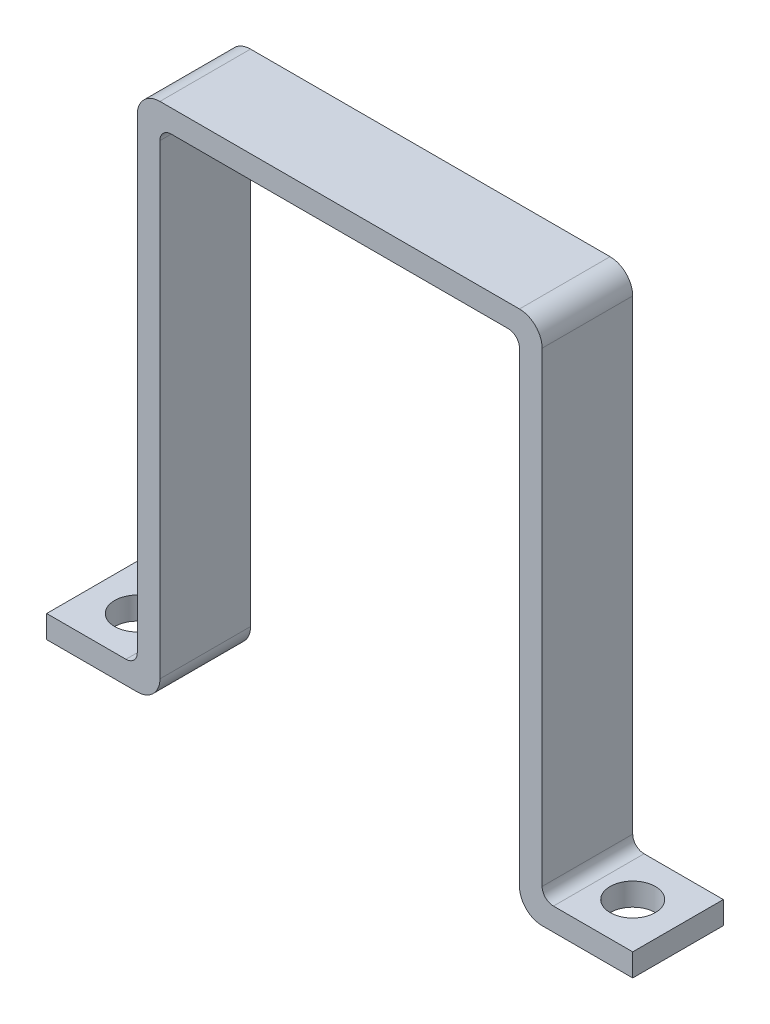
ISO-10303-21;
HEADER;
FILE_DESCRIPTION(('STEP AP214'),'2;1');
FILE_NAME('part.step','',(''),(''),'','','');
FILE_SCHEMA(('AUTOMOTIVE_DESIGN { 1 0 10303 214 1 1 1 1 }'));
ENDSEC;
DATA;
#1=APPLICATION_CONTEXT('core data for automotive mechanical design processes');
#2=APPLICATION_PROTOCOL_DEFINITION('international standard','automotive_design',2000,#1);
#3=PRODUCT_CONTEXT('',#1,'mechanical');
#4=PRODUCT('Part','Part','',(#3));
#5=PRODUCT_RELATED_PRODUCT_CATEGORY('part','',(#4));
#6=PRODUCT_DEFINITION_FORMATION('','',#4);
#7=PRODUCT_DEFINITION_CONTEXT('part definition',#1,'design');
#8=PRODUCT_DEFINITION('design','',#6,#7);
#9=PRODUCT_DEFINITION_SHAPE('','',#8);
#10=(LENGTH_UNIT() NAMED_UNIT(*) SI_UNIT(.MILLI.,.METRE.));
#11=(NAMED_UNIT(*) PLANE_ANGLE_UNIT() SI_UNIT($,.RADIAN.));
#12=(NAMED_UNIT(*) SI_UNIT($,.STERADIAN.) SOLID_ANGLE_UNIT());
#13=UNCERTAINTY_MEASURE_WITH_UNIT(LENGTH_MEASURE(1.E-05),#10,'distance_accuracy_value','');
#14=(GEOMETRIC_REPRESENTATION_CONTEXT(3) GLOBAL_UNCERTAINTY_ASSIGNED_CONTEXT((#13)) GLOBAL_UNIT_ASSIGNED_CONTEXT((#10,
#11,#12)) REPRESENTATION_CONTEXT('',''));
#15=CARTESIAN_POINT('',(0.,0.,0.));
#16=DIRECTION('',(0.,0.,1.));
#17=DIRECTION('',(1.,0.,0.));
#18=AXIS2_PLACEMENT_3D('',#15,#16,#17);
#19=CARTESIAN_POINT('',(0.,70.104,0.));
#20=DIRECTION('',(0.,1.,0.));
#21=DIRECTION('',(0.,0.,1.));
#22=AXIS2_PLACEMENT_3D('',#19,#20,#21);
#23=PLANE('',#22);
#24=DIRECTION('',(1.,0.,0.));
#25=VECTOR('',#24,1.);
#26=CARTESIAN_POINT('',(0.,70.104,6.35000000000001));
#27=LINE('',#26,#25);
#28=CARTESIAN_POINT('',(-58.3375,70.104,6.35000000000001));
#29=VERTEX_POINT('',#28);
#30=CARTESIAN_POINT('',(-11.1125,70.104,6.35000000000001));
#31=VERTEX_POINT('',#30);
#32=EDGE_CURVE('E234',#29,#31,#27,.T.);
#33=ORIENTED_EDGE('',*,*,#32,.F.);
#34=DIRECTION('',(0.,0.,1.));
#35=VECTOR('',#34,1.);
#36=CARTESIAN_POINT('',(-58.3375,70.104,0.));
#37=LINE('',#36,#35);
#38=CARTESIAN_POINT('',(-58.3375,70.104,-6.34999999999999));
#39=VERTEX_POINT('',#38);
#40=EDGE_CURVE('E381',#29,#39,#37,.F.);
#41=ORIENTED_EDGE('',*,*,#40,.T.);
#42=DIRECTION('',(-1.,0.,0.));
#43=VECTOR('',#42,1.);
#44=CARTESIAN_POINT('',(0.,70.104,-6.34999999999999));
#45=LINE('',#44,#43);
#46=CARTESIAN_POINT('',(-11.1125,70.104,-6.34999999999999));
#47=VERTEX_POINT('',#46);
#48=EDGE_CURVE('E237',#47,#39,#45,.T.);
#49=ORIENTED_EDGE('',*,*,#48,.F.);
#50=DIRECTION('',(0.,0.,-1.));
#51=VECTOR('',#50,1.);
#52=CARTESIAN_POINT('',(-11.1125,70.104,6.35000000000001));
#53=LINE('',#52,#51);
#54=EDGE_CURVE('E378',#47,#31,#53,.F.);
#55=ORIENTED_EDGE('',*,*,#54,.T.);
#56=EDGE_LOOP('',(#33,#41,#49,#55));
#57=FACE_BOUND('',#56,.T.);
#58=ADVANCED_FACE('F41',(#57),#23,.F.);
#59=CARTESIAN_POINT('',(-59.925,3.175,0.));
#60=DIRECTION('',(1.,0.,0.));
#61=DIRECTION('',(0.,0.,-1.));
#62=AXIS2_PLACEMENT_3D('',#59,#60,#61);
#63=PLANE('',#62);
#64=DIRECTION('',(0.,-1.,0.));
#65=VECTOR('',#64,1.);
#66=CARTESIAN_POINT('',(-59.925,3.175,-6.34999999999999));
#67=LINE('',#66,#65);
#68=CARTESIAN_POINT('',(-59.925,68.5165,-6.34999999999999));
#69=VERTEX_POINT('',#68);
#70=CARTESIAN_POINT('',(-59.925,3.175,-6.34999999999999));
#71=VERTEX_POINT('',#70);
#72=EDGE_CURVE('E300',#69,#71,#67,.T.);
#73=ORIENTED_EDGE('',*,*,#72,.F.);
#74=DIRECTION('',(0.,0.,1.));
#75=VECTOR('',#74,1.);
#76=CARTESIAN_POINT('',(-59.925,68.5165,0.));
#77=LINE('',#76,#75);
#78=CARTESIAN_POINT('',(-59.925,68.5165,6.35000000000001));
#79=VERTEX_POINT('',#78);
#80=EDGE_CURVE('E374',#69,#79,#77,.T.);
#81=ORIENTED_EDGE('',*,*,#80,.T.);
#82=DIRECTION('',(0.,-1.,0.));
#83=VECTOR('',#82,1.);
#84=CARTESIAN_POINT('',(-59.925,3.175,6.35000000000001));
#85=LINE('',#84,#83);
#86=CARTESIAN_POINT('',(-59.925,3.175,6.35000000000001));
#87=VERTEX_POINT('',#86);
#88=EDGE_CURVE('E303',#79,#87,#85,.T.);
#89=ORIENTED_EDGE('',*,*,#88,.T.);
#90=DIRECTION('',(0.,0.,1.));
#91=VECTOR('',#90,1.);
#92=CARTESIAN_POINT('',(-59.925,3.175,-6.34999999999999));
#93=LINE('',#92,#91);
#94=EDGE_CURVE('E323',#87,#71,#93,.F.);
#95=ORIENTED_EDGE('',*,*,#94,.T.);
#96=EDGE_LOOP('',(#73,#81,#89,#95));
#97=FACE_BOUND('',#96,.T.);
#98=ADVANCED_FACE('F478',(#97),#63,.T.);
#99=CARTESIAN_POINT('',(0.,3.175,6.35000000000001));
#100=DIRECTION('',(0.,0.,-1.));
#101=DIRECTION('',(-1.,0.,0.));
#102=AXIS2_PLACEMENT_3D('',#99,#100,#101);
#103=PLANE('',#102);
#104=DIRECTION('',(1.,0.,0.));
#105=VECTOR('',#104,1.);
#106=CARTESIAN_POINT('',(0.,0.,6.35000000000001));
#107=LINE('',#106,#105);
#108=CARTESIAN_POINT('',(-75.8,0.,6.35000000000001));
#109=VERTEX_POINT('',#108);
#110=CARTESIAN_POINT('',(-63.1,0.,6.35000000000001));
#111=VERTEX_POINT('',#110);
#112=EDGE_CURVE('E285',#109,#111,#107,.T.);
#113=ORIENTED_EDGE('',*,*,#112,.T.);
#114=CARTESIAN_POINT('',(-63.1,3.175,6.35000000000001));
#115=DIRECTION('',(0.,0.,-1.));
#116=DIRECTION('',(-1.,0.,0.));
#117=AXIS2_PLACEMENT_3D('',#114,#115,#116);
#118=CIRCLE('',#117,3.175);
#119=EDGE_CURVE('E319',#111,#87,#118,.F.);
#120=ORIENTED_EDGE('',*,*,#119,.T.);
#121=ORIENTED_EDGE('',*,*,#88,.F.);
#122=CARTESIAN_POINT('',(-58.3375,68.5165,6.35000000000001));
#123=DIRECTION('',(0.,0.,-1.));
#124=DIRECTION('',(-1.,0.,0.));
#125=AXIS2_PLACEMENT_3D('',#122,#123,#124);
#126=CIRCLE('',#125,1.5875);
#127=EDGE_CURVE('E399',#79,#29,#126,.T.);
#128=ORIENTED_EDGE('',*,*,#127,.T.);
#129=ORIENTED_EDGE('',*,*,#32,.T.);
#130=CARTESIAN_POINT('',(-11.1125,68.5165,6.35000000000001));
#131=DIRECTION('',(0.,0.,-1.));
#132=DIRECTION('',(-1.,0.,0.));
#133=AXIS2_PLACEMENT_3D('',#130,#131,#132);
#134=CIRCLE('',#133,1.5875);
#135=CARTESIAN_POINT('',(-9.525,68.5165,6.35));
#136=VERTEX_POINT('',#135);
#137=EDGE_CURVE('E11',#31,#136,#134,.T.);
#138=ORIENTED_EDGE('',*,*,#137,.T.);
#139=DIRECTION('',(0.,-1.,0.));
#140=VECTOR('',#139,1.);
#141=CARTESIAN_POINT('',(-9.525,3.175,6.35));
#142=LINE('',#141,#140);
#143=CARTESIAN_POINT('',(-9.525,3.175,6.35));
#144=VERTEX_POINT('',#143);
#145=EDGE_CURVE('E189',#136,#144,#142,.T.);
#146=ORIENTED_EDGE('',*,*,#145,.T.);
#147=CARTESIAN_POINT('',(-6.35,3.175,6.35000000000001));
#148=DIRECTION('',(0.,0.,-1.));
#149=DIRECTION('',(-1.,0.,0.));
#150=AXIS2_PLACEMENT_3D('',#147,#148,#149);
#151=CIRCLE('',#150,3.175);
#152=CARTESIAN_POINT('',(-6.35,0.,6.35));
#153=VERTEX_POINT('',#152);
#154=EDGE_CURVE('E316',#144,#153,#151,.F.);
#155=ORIENTED_EDGE('',*,*,#154,.T.);
#156=DIRECTION('',(-1.,0.,0.));
#157=VECTOR('',#156,1.);
#158=CARTESIAN_POINT('',(0.,0.,6.35));
#159=LINE('',#158,#157);
#160=CARTESIAN_POINT('',(6.35,0.,6.35));
#161=VERTEX_POINT('',#160);
#162=EDGE_CURVE('E184',#161,#153,#159,.T.);
#163=ORIENTED_EDGE('',*,*,#162,.F.);
#164=DIRECTION('',(0.,-1.,0.));
#165=VECTOR('',#164,1.);
#166=CARTESIAN_POINT('',(6.35,3.175,6.35));
#167=LINE('',#166,#165);
#168=CARTESIAN_POINT('',(6.35,3.175,6.35));
#169=VERTEX_POINT('',#168);
#170=EDGE_CURVE('E177',#169,#161,#167,.T.);
#171=ORIENTED_EDGE('',*,*,#170,.F.);
#172=DIRECTION('',(-1.,0.,0.));
#173=VECTOR('',#172,1.);
#174=CARTESIAN_POINT('',(0.,3.175,6.35));
#175=LINE('',#174,#173);
#176=CARTESIAN_POINT('',(-4.7625,3.175,6.35));
#177=VERTEX_POINT('',#176);
#178=EDGE_CURVE('E182',#169,#177,#175,.T.);
#179=ORIENTED_EDGE('',*,*,#178,.T.);
#180=CARTESIAN_POINT('',(-4.7625,4.7625,6.35000000000001));
#181=DIRECTION('',(0.,0.,-1.));
#182=DIRECTION('',(-1.,0.,0.));
#183=AXIS2_PLACEMENT_3D('',#180,#181,#182);
#184=CIRCLE('',#183,1.5875);
#185=CARTESIAN_POINT('',(-6.35,4.7625,6.35));
#186=VERTEX_POINT('',#185);
#187=EDGE_CURVE('E393',#177,#186,#184,.T.);
#188=ORIENTED_EDGE('',*,*,#187,.T.);
#189=DIRECTION('',(0.,1.,0.));
#190=VECTOR('',#189,1.);
#191=CARTESIAN_POINT('',(-6.35,70.104,6.35));
#192=LINE('',#191,#190);
#193=CARTESIAN_POINT('',(-6.35,70.104,6.35));
#194=VERTEX_POINT('',#193);
#195=EDGE_CURVE('E241',#186,#194,#192,.T.);
#196=ORIENTED_EDGE('',*,*,#195,.T.);
#197=CARTESIAN_POINT('',(-9.525,70.104,6.35000000000001));
#198=DIRECTION('',(0.,0.,-1.));
#199=DIRECTION('',(-1.,0.,0.));
#200=AXIS2_PLACEMENT_3D('',#197,#198,#199);
#201=CIRCLE('',#200,3.175);
#202=CARTESIAN_POINT('',(-9.525,73.279,6.35000000000001));
#203=VERTEX_POINT('',#202);
#204=EDGE_CURVE('E310',#194,#203,#201,.F.);
#205=ORIENTED_EDGE('',*,*,#204,.T.);
#206=DIRECTION('',(1.,0.,0.));
#207=VECTOR('',#206,1.);
#208=CARTESIAN_POINT('',(0.,73.279,6.35000000000001));
#209=LINE('',#208,#207);
#210=CARTESIAN_POINT('',(-59.925,73.279,6.35000000000001));
#211=VERTEX_POINT('',#210);
#212=EDGE_CURVE('E251',#211,#203,#209,.T.);
#213=ORIENTED_EDGE('',*,*,#212,.F.);
#214=CARTESIAN_POINT('',(-59.925,70.104,6.35000000000001));
#215=DIRECTION('',(0.,0.,-1.));
#216=DIRECTION('',(-1.,0.,0.));
#217=AXIS2_PLACEMENT_3D('',#214,#215,#216);
#218=CIRCLE('',#217,3.175);
#219=CARTESIAN_POINT('',(-63.1,70.104,6.35000000000001));
#220=VERTEX_POINT('',#219);
#221=EDGE_CURVE('E313',#211,#220,#218,.F.);
#222=ORIENTED_EDGE('',*,*,#221,.T.);
#223=DIRECTION('',(0.,-1.,0.));
#224=VECTOR('',#223,1.);
#225=CARTESIAN_POINT('',(-63.1,73.279,6.35000000000001));
#226=LINE('',#225,#224);
#227=CARTESIAN_POINT('',(-63.1,4.7625,6.35000000000001));
#228=VERTEX_POINT('',#227);
#229=EDGE_CURVE('E255',#220,#228,#226,.T.);
#230=ORIENTED_EDGE('',*,*,#229,.T.);
#231=CARTESIAN_POINT('',(-64.6875,4.7625,6.35000000000001));
#232=DIRECTION('',(0.,0.,-1.));
#233=DIRECTION('',(-1.,0.,0.));
#234=AXIS2_PLACEMENT_3D('',#231,#232,#233);
#235=CIRCLE('',#234,1.5875);
#236=CARTESIAN_POINT('',(-64.6875,3.175,6.35000000000001));
#237=VERTEX_POINT('',#236);
#238=EDGE_CURVE('E387',#228,#237,#235,.T.);
#239=ORIENTED_EDGE('',*,*,#238,.T.);
#240=DIRECTION('',(1.,0.,0.));
#241=VECTOR('',#240,1.);
#242=CARTESIAN_POINT('',(0.,3.175,6.35000000000001));
#243=LINE('',#242,#241);
#244=CARTESIAN_POINT('',(-75.8,3.175,6.35000000000001));
#245=VERTEX_POINT('',#244);
#246=EDGE_CURVE('E268',#245,#237,#243,.T.);
#247=ORIENTED_EDGE('',*,*,#246,.F.);
#248=DIRECTION('',(0.,-1.,0.));
#249=VECTOR('',#248,1.);
#250=CARTESIAN_POINT('',(-75.8,3.175,6.35000000000001));
#251=LINE('',#250,#249);
#252=EDGE_CURVE('E281',#245,#109,#251,.T.);
#253=ORIENTED_EDGE('',*,*,#252,.T.);
#254=EDGE_LOOP('',(#113,#120,#121,#128,#129,#138,#146,#155,#163,#171,#179,#188,#196,#205,#213,
#222,#230,#239,#247,#253));
#255=FACE_BOUND('',#254,.T.);
#256=ADVANCED_FACE('F180',(#255),#103,.F.);
#257=CARTESIAN_POINT('',(0.,3.175,-6.34999999999999));
#258=DIRECTION('',(0.,0.,-1.));
#259=DIRECTION('',(-1.,0.,0.));
#260=AXIS2_PLACEMENT_3D('',#257,#258,#259);
#261=PLANE('',#260);
#262=ORIENTED_EDGE('',*,*,#48,.T.);
#263=CARTESIAN_POINT('',(-58.3375,68.5165,-6.34999999999999));
#264=DIRECTION('',(0.,0.,-1.));
#265=DIRECTION('',(-1.,0.,0.));
#266=AXIS2_PLACEMENT_3D('',#263,#264,#265);
#267=CIRCLE('',#266,1.5875);
#268=EDGE_CURVE('E402',#39,#69,#267,.F.);
#269=ORIENTED_EDGE('',*,*,#268,.T.);
#270=ORIENTED_EDGE('',*,*,#72,.T.);
#271=CARTESIAN_POINT('',(-63.1,3.175,-6.34999999999999));
#272=DIRECTION('',(0.,0.,-1.));
#273=DIRECTION('',(-1.,0.,0.));
#274=AXIS2_PLACEMENT_3D('',#271,#272,#273);
#275=CIRCLE('',#274,3.175);
#276=CARTESIAN_POINT('',(-63.1,0.,-6.34999999999999));
#277=VERTEX_POINT('',#276);
#278=EDGE_CURVE('E338',#71,#277,#275,.T.);
#279=ORIENTED_EDGE('',*,*,#278,.T.);
#280=DIRECTION('',(1.,0.,0.));
#281=VECTOR('',#280,1.);
#282=CARTESIAN_POINT('',(0.,0.,-6.34999999999999));
#283=LINE('',#282,#281);
#284=CARTESIAN_POINT('',(-75.8,0.,-6.34999999999999));
#285=VERTEX_POINT('',#284);
#286=EDGE_CURVE('E288',#285,#277,#283,.T.);
#287=ORIENTED_EDGE('',*,*,#286,.F.);
#288=DIRECTION('',(0.,-1.,0.));
#289=VECTOR('',#288,1.);
#290=CARTESIAN_POINT('',(-75.8,3.175,-6.34999999999999));
#291=LINE('',#290,#289);
#292=CARTESIAN_POINT('',(-75.8,3.175,-6.34999999999999));
#293=VERTEX_POINT('',#292);
#294=EDGE_CURVE('E297',#293,#285,#291,.T.);
#295=ORIENTED_EDGE('',*,*,#294,.F.);
#296=DIRECTION('',(1.,0.,0.));
#297=VECTOR('',#296,1.);
#298=CARTESIAN_POINT('',(0.,3.175,-6.34999999999999));
#299=LINE('',#298,#297);
#300=CARTESIAN_POINT('',(-64.6875,3.175,-6.34999999999999));
#301=VERTEX_POINT('',#300);
#302=EDGE_CURVE('E273',#293,#301,#299,.T.);
#303=ORIENTED_EDGE('',*,*,#302,.T.);
#304=CARTESIAN_POINT('',(-64.6875,4.7625,-6.34999999999999));
#305=DIRECTION('',(0.,0.,-1.));
#306=DIRECTION('',(-1.,0.,0.));
#307=AXIS2_PLACEMENT_3D('',#304,#305,#306);
#308=CIRCLE('',#307,1.5875);
#309=CARTESIAN_POINT('',(-63.1,4.7625,-6.34999999999999));
#310=VERTEX_POINT('',#309);
#311=EDGE_CURVE('E390',#301,#310,#308,.F.);
#312=ORIENTED_EDGE('',*,*,#311,.T.);
#313=DIRECTION('',(0.,-1.,0.));
#314=VECTOR('',#313,1.);
#315=CARTESIAN_POINT('',(-63.1,73.279,-6.34999999999999));
#316=LINE('',#315,#314);
#317=CARTESIAN_POINT('',(-63.1,70.104,-6.34999999999999));
#318=VERTEX_POINT('',#317);
#319=EDGE_CURVE('E259',#318,#310,#316,.T.);
#320=ORIENTED_EDGE('',*,*,#319,.F.);
#321=CARTESIAN_POINT('',(-59.925,70.104,-6.34999999999999));
#322=DIRECTION('',(0.,0.,-1.));
#323=DIRECTION('',(-1.,0.,0.));
#324=AXIS2_PLACEMENT_3D('',#321,#322,#323);
#325=CIRCLE('',#324,3.175);
#326=CARTESIAN_POINT('',(-59.925,73.279,-6.34999999999999));
#327=VERTEX_POINT('',#326);
#328=EDGE_CURVE('E331',#318,#327,#325,.T.);
#329=ORIENTED_EDGE('',*,*,#328,.T.);
#330=DIRECTION('',(-1.,0.,0.));
#331=VECTOR('',#330,1.);
#332=CARTESIAN_POINT('',(0.,73.279,-6.34999999999999));
#333=LINE('',#332,#331);
#334=CARTESIAN_POINT('',(-9.525,73.279,-6.34999999999999));
#335=VERTEX_POINT('',#334);
#336=EDGE_CURVE('E245',#335,#327,#333,.T.);
#337=ORIENTED_EDGE('',*,*,#336,.F.);
#338=CARTESIAN_POINT('',(-9.525,70.104,-6.34999999999999));
#339=DIRECTION('',(0.,0.,-1.));
#340=DIRECTION('',(-1.,0.,0.));
#341=AXIS2_PLACEMENT_3D('',#338,#339,#340);
#342=CIRCLE('',#341,3.175);
#343=CARTESIAN_POINT('',(-6.35,70.104,-6.34999999999999));
#344=VERTEX_POINT('',#343);
#345=EDGE_CURVE('E327',#335,#344,#342,.T.);
#346=ORIENTED_EDGE('',*,*,#345,.T.);
#347=DIRECTION('',(0.,1.,0.));
#348=VECTOR('',#347,1.);
#349=CARTESIAN_POINT('',(-6.35,70.104,-6.34999999999999));
#350=LINE('',#349,#348);
#351=CARTESIAN_POINT('',(-6.35,4.7625,-6.34999999999999));
#352=VERTEX_POINT('',#351);
#353=EDGE_CURVE('E242',#352,#344,#350,.T.);
#354=ORIENTED_EDGE('',*,*,#353,.F.);
#355=CARTESIAN_POINT('',(-4.7625,4.7625,-6.34999999999999));
#356=DIRECTION('',(0.,0.,-1.));
#357=DIRECTION('',(-1.,0.,0.));
#358=AXIS2_PLACEMENT_3D('',#355,#356,#357);
#359=CIRCLE('',#358,1.5875);
#360=CARTESIAN_POINT('',(-4.7625,3.175,-6.35));
#361=VERTEX_POINT('',#360);
#362=EDGE_CURVE('E396',#352,#361,#359,.F.);
#363=ORIENTED_EDGE('',*,*,#362,.T.);
#364=DIRECTION('',(1.,0.,0.));
#365=VECTOR('',#364,1.);
#366=CARTESIAN_POINT('',(0.,3.175,-6.35));
#367=LINE('',#366,#365);
#368=CARTESIAN_POINT('',(6.35,3.175,-6.35));
#369=VERTEX_POINT('',#368);
#370=EDGE_CURVE('E207',#361,#369,#367,.T.);
#371=ORIENTED_EDGE('',*,*,#370,.T.);
#372=DIRECTION('',(0.,-1.,0.));
#373=VECTOR('',#372,1.);
#374=CARTESIAN_POINT('',(6.35,3.175,-6.35));
#375=LINE('',#374,#373);
#376=CARTESIAN_POINT('',(6.35,0.,-6.35));
#377=VERTEX_POINT('',#376);
#378=EDGE_CURVE('E190',#369,#377,#375,.T.);
#379=ORIENTED_EDGE('',*,*,#378,.T.);
#380=DIRECTION('',(1.,0.,0.));
#381=VECTOR('',#380,1.);
#382=CARTESIAN_POINT('',(0.,0.,-6.35));
#383=LINE('',#382,#381);
#384=CARTESIAN_POINT('',(-6.35,0.,-6.35));
#385=VERTEX_POINT('',#384);
#386=EDGE_CURVE('E216',#385,#377,#383,.T.);
#387=ORIENTED_EDGE('',*,*,#386,.F.);
#388=CARTESIAN_POINT('',(-6.35,3.175,-6.34999999999999));
#389=DIRECTION('',(0.,0.,-1.));
#390=DIRECTION('',(-1.,0.,0.));
#391=AXIS2_PLACEMENT_3D('',#388,#389,#390);
#392=CIRCLE('',#391,3.175);
#393=CARTESIAN_POINT('',(-9.525,3.175,-6.35));
#394=VERTEX_POINT('',#393);
#395=EDGE_CURVE('E334',#385,#394,#392,.T.);
#396=ORIENTED_EDGE('',*,*,#395,.T.);
#397=DIRECTION('',(0.,-1.,0.));
#398=VECTOR('',#397,1.);
#399=CARTESIAN_POINT('',(-9.525,3.175,-6.35));
#400=LINE('',#399,#398);
#401=CARTESIAN_POINT('',(-9.525,68.5165,-6.35));
#402=VERTEX_POINT('',#401);
#403=EDGE_CURVE('E231',#402,#394,#400,.T.);
#404=ORIENTED_EDGE('',*,*,#403,.F.);
#405=CARTESIAN_POINT('',(-11.1125,68.5165,-6.34999999999999));
#406=DIRECTION('',(0.,0.,-1.));
#407=DIRECTION('',(-1.,0.,0.));
#408=AXIS2_PLACEMENT_3D('',#405,#406,#407);
#409=CIRCLE('',#408,1.5875);
#410=EDGE_CURVE('E50',#402,#47,#409,.F.);
#411=ORIENTED_EDGE('',*,*,#410,.T.);
#412=EDGE_LOOP('',(#262,#269,#270,#279,#287,#295,#303,#312,#320,#329,#337,#346,#354,#363,#371,
#379,#387,#396,#404,#411));
#413=FACE_BOUND('',#412,.T.);
#414=ADVANCED_FACE('F408',(#413),#261,.T.);
#415=CARTESIAN_POINT('',(-69.45,3.175,0.));
#416=DIRECTION('',(0.,-1.,0.));
#417=DIRECTION('',(0.,0.,-1.));
#418=AXIS2_PLACEMENT_3D('',#415,#416,#417);
#419=CYLINDRICAL_SURFACE('',#418,3.175);
#420=CARTESIAN_POINT('',(-69.45,3.175,0.));
#421=DIRECTION('',(0.,1.,0.));
#422=DIRECTION('',(0.,0.,1.));
#423=AXIS2_PLACEMENT_3D('',#420,#421,#422);
#424=CIRCLE('',#423,3.175);
#425=CARTESIAN_POINT('',(-69.45,3.175,3.175));
#426=VERTEX_POINT('',#425);
#427=EDGE_CURVE('E264',#426,#426,#424,.T.);
#428=ORIENTED_EDGE('',*,*,#427,.T.);
#429=EDGE_LOOP('',(#428));
#430=FACE_BOUND('',#429,.T.);
#431=CARTESIAN_POINT('',(-69.45,0.,0.));
#432=DIRECTION('',(0.,1.,0.));
#433=DIRECTION('',(0.,0.,1.));
#434=AXIS2_PLACEMENT_3D('',#431,#432,#433);
#435=CIRCLE('',#434,3.175);
#436=CARTESIAN_POINT('',(-69.45,0.,3.175));
#437=VERTEX_POINT('',#436);
#438=EDGE_CURVE('E263',#437,#437,#435,.T.);
#439=ORIENTED_EDGE('',*,*,#438,.F.);
#440=EDGE_LOOP('',(#439));
#441=FACE_BOUND('',#440,.T.);
#442=ADVANCED_FACE('F510',(#430,#441),#419,.F.);
#443=CARTESIAN_POINT('',(-75.8,3.175,0.));
#444=DIRECTION('',(-1.,0.,0.));
#445=DIRECTION('',(0.,0.,1.));
#446=AXIS2_PLACEMENT_3D('',#443,#444,#445);
#447=PLANE('',#446);
#448=DIRECTION('',(0.,0.,-1.));
#449=VECTOR('',#448,1.);
#450=CARTESIAN_POINT('',(-75.8,0.,0.));
#451=LINE('',#450,#449);
#452=EDGE_CURVE('E269',#109,#285,#451,.T.);
#453=ORIENTED_EDGE('',*,*,#452,.F.);
#454=ORIENTED_EDGE('',*,*,#252,.F.);
#455=DIRECTION('',(0.,0.,-1.));
#456=VECTOR('',#455,1.);
#457=CARTESIAN_POINT('',(-75.8,3.175,0.));
#458=LINE('',#457,#456);
#459=EDGE_CURVE('E277',#245,#293,#458,.T.);
#460=ORIENTED_EDGE('',*,*,#459,.T.);
#461=ORIENTED_EDGE('',*,*,#294,.T.);
#462=EDGE_LOOP('',(#453,#454,#460,#461));
#463=FACE_BOUND('',#462,.T.);
#464=ADVANCED_FACE('F465',(#463),#447,.T.);
#465=CARTESIAN_POINT('',(0.,3.175,0.));
#466=DIRECTION('',(0.,1.,0.));
#467=DIRECTION('',(0.,0.,1.));
#468=AXIS2_PLACEMENT_3D('',#465,#466,#467);
#469=PLANE('',#468);
#470=ORIENTED_EDGE('',*,*,#246,.T.);
#471=DIRECTION('',(0.,0.,1.));
#472=VECTOR('',#471,1.);
#473=CARTESIAN_POINT('',(-64.6875,3.175,0.));
#474=LINE('',#473,#472);
#475=EDGE_CURVE('E366',#237,#301,#474,.F.);
#476=ORIENTED_EDGE('',*,*,#475,.T.);
#477=ORIENTED_EDGE('',*,*,#302,.F.);
#478=ORIENTED_EDGE('',*,*,#459,.F.);
#479=EDGE_LOOP('',(#470,#476,#477,#478));
#480=FACE_BOUND('',#479,.T.);
#481=ORIENTED_EDGE('',*,*,#427,.F.);
#482=EDGE_LOOP('',(#481));
#483=FACE_BOUND('',#482,.T.);
#484=ADVANCED_FACE('F460',(#480,#483),#469,.T.);
#485=CARTESIAN_POINT('',(0.,0.,0.));
#486=DIRECTION('',(0.,1.,0.));
#487=DIRECTION('',(0.,0.,1.));
#488=AXIS2_PLACEMENT_3D('',#485,#486,#487);
#489=PLANE('',#488);
#490=ORIENTED_EDGE('',*,*,#438,.T.);
#491=EDGE_LOOP('',(#490));
#492=FACE_BOUND('',#491,.T.);
#493=ORIENTED_EDGE('',*,*,#286,.T.);
#494=DIRECTION('',(0.,0.,1.));
#495=VECTOR('',#494,1.);
#496=CARTESIAN_POINT('',(-63.1,0.,6.35000000000001));
#497=LINE('',#496,#495);
#498=EDGE_CURVE('E306',#277,#111,#497,.T.);
#499=ORIENTED_EDGE('',*,*,#498,.T.);
#500=ORIENTED_EDGE('',*,*,#112,.F.);
#501=ORIENTED_EDGE('',*,*,#452,.T.);
#502=EDGE_LOOP('',(#493,#499,#500,#501));
#503=FACE_BOUND('',#502,.T.);
#504=ADVANCED_FACE('F469',(#492,#503),#489,.F.);
#505=CARTESIAN_POINT('',(-63.1,73.279,0.));
#506=DIRECTION('',(1.,0.,0.));
#507=DIRECTION('',(0.,0.,-1.));
#508=AXIS2_PLACEMENT_3D('',#505,#506,#507);
#509=PLANE('',#508);
#510=ORIENTED_EDGE('',*,*,#319,.T.);
#511=DIRECTION('',(0.,0.,1.));
#512=VECTOR('',#511,1.);
#513=CARTESIAN_POINT('',(-63.1,4.7625,0.));
#514=LINE('',#513,#512);
#515=EDGE_CURVE('E362',#310,#228,#514,.T.);
#516=ORIENTED_EDGE('',*,*,#515,.T.);
#517=ORIENTED_EDGE('',*,*,#229,.F.);
#518=DIRECTION('',(0.,0.,1.));
#519=VECTOR('',#518,1.);
#520=CARTESIAN_POINT('',(-63.1,70.104,-6.34999999999999));
#521=LINE('',#520,#519);
#522=EDGE_CURVE('E355',#220,#318,#521,.F.);
#523=ORIENTED_EDGE('',*,*,#522,.T.);
#524=EDGE_LOOP('',(#510,#516,#517,#523));
#525=FACE_BOUND('',#524,.T.);
#526=ADVANCED_FACE('F450',(#525),#509,.F.);
#527=CARTESIAN_POINT('',(0.,73.279,0.));
#528=DIRECTION('',(0.,1.,0.));
#529=DIRECTION('',(0.,0.,1.));
#530=AXIS2_PLACEMENT_3D('',#527,#528,#529);
#531=PLANE('',#530);
#532=ORIENTED_EDGE('',*,*,#336,.T.);
#533=DIRECTION('',(0.,0.,1.));
#534=VECTOR('',#533,1.);
#535=CARTESIAN_POINT('',(-59.925,73.279,6.35000000000001));
#536=LINE('',#535,#534);
#537=EDGE_CURVE('E351',#327,#211,#536,.T.);
#538=ORIENTED_EDGE('',*,*,#537,.T.);
#539=ORIENTED_EDGE('',*,*,#212,.T.);
#540=DIRECTION('',(0.,0.,1.));
#541=VECTOR('',#540,1.);
#542=CARTESIAN_POINT('',(-9.525,73.279,-6.34999999999999));
#543=LINE('',#542,#541);
#544=EDGE_CURVE('E348',#203,#335,#543,.F.);
#545=ORIENTED_EDGE('',*,*,#544,.T.);
#546=EDGE_LOOP('',(#532,#538,#539,#545));
#547=FACE_BOUND('',#546,.T.);
#548=ADVANCED_FACE('F441',(#547),#531,.T.);
#549=CARTESIAN_POINT('',(-6.35,70.104,0.));
#550=DIRECTION('',(-1.,0.,0.));
#551=DIRECTION('',(0.,0.,1.));
#552=AXIS2_PLACEMENT_3D('',#549,#550,#551);
#553=PLANE('',#552);
#554=ORIENTED_EDGE('',*,*,#195,.F.);
#555=DIRECTION('',(0.,0.,1.));
#556=VECTOR('',#555,1.);
#557=CARTESIAN_POINT('',(-6.35,4.7625,0.));
#558=LINE('',#557,#556);
#559=EDGE_CURVE('E371',#186,#352,#558,.F.);
#560=ORIENTED_EDGE('',*,*,#559,.T.);
#561=ORIENTED_EDGE('',*,*,#353,.T.);
#562=DIRECTION('',(0.,0.,1.));
#563=VECTOR('',#562,1.);
#564=CARTESIAN_POINT('',(-6.35,70.104,6.35));
#565=LINE('',#564,#563);
#566=EDGE_CURVE('E358',#344,#194,#565,.T.);
#567=ORIENTED_EDGE('',*,*,#566,.T.);
#568=EDGE_LOOP('',(#554,#560,#561,#567));
#569=FACE_BOUND('',#568,.T.);
#570=ADVANCED_FACE('F433',(#569),#553,.F.);
#571=CARTESIAN_POINT('',(-9.525,3.175,0.));
#572=DIRECTION('',(1.,0.,0.));
#573=DIRECTION('',(0.,0.,-1.));
#574=AXIS2_PLACEMENT_3D('',#571,#572,#573);
#575=PLANE('',#574);
#576=ORIENTED_EDGE('',*,*,#145,.F.);
#577=DIRECTION('',(0.,0.,-1.));
#578=VECTOR('',#577,1.);
#579=CARTESIAN_POINT('',(-9.525,68.5165,-6.34999999999999));
#580=LINE('',#579,#578);
#581=EDGE_CURVE('E384',#136,#402,#580,.T.);
#582=ORIENTED_EDGE('',*,*,#581,.T.);
#583=ORIENTED_EDGE('',*,*,#403,.T.);
#584=DIRECTION('',(0.,0.,1.));
#585=VECTOR('',#584,1.);
#586=CARTESIAN_POINT('',(-9.525,3.175,0.));
#587=LINE('',#586,#585);
#588=EDGE_CURVE('E341',#394,#144,#587,.T.);
#589=ORIENTED_EDGE('',*,*,#588,.T.);
#590=EDGE_LOOP('',(#576,#582,#583,#589));
#591=FACE_BOUND('',#590,.T.);
#592=ADVANCED_FACE('F414',(#591),#575,.F.);
#593=CARTESIAN_POINT('',(0.,3.175,0.));
#594=DIRECTION('',(0.,1.,0.));
#595=DIRECTION('',(0.,0.,1.));
#596=AXIS2_PLACEMENT_3D('',#593,#594,#595);
#597=PLANE('',#596);
#598=CARTESIAN_POINT('',(0.,3.175,0.));
#599=DIRECTION('',(0.,1.,0.));
#600=DIRECTION('',(0.,0.,1.));
#601=AXIS2_PLACEMENT_3D('',#598,#599,#600);
#602=CIRCLE('',#601,3.175);
#603=CARTESIAN_POINT('',(0.,3.175,3.175));
#604=VERTEX_POINT('',#603);
#605=EDGE_CURVE('E200',#604,#604,#602,.T.);
#606=ORIENTED_EDGE('',*,*,#605,.F.);
#607=EDGE_LOOP('',(#606));
#608=FACE_BOUND('',#607,.T.);
#609=ORIENTED_EDGE('',*,*,#370,.F.);
#610=DIRECTION('',(0.,0.,1.));
#611=VECTOR('',#610,1.);
#612=CARTESIAN_POINT('',(-4.7625,3.175,0.));
#613=LINE('',#612,#611);
#614=EDGE_CURVE('E205',#361,#177,#613,.T.);
#615=ORIENTED_EDGE('',*,*,#614,.T.);
#616=ORIENTED_EDGE('',*,*,#178,.F.);
#617=DIRECTION('',(0.,0.,-1.));
#618=VECTOR('',#617,1.);
#619=CARTESIAN_POINT('',(6.35,3.175,0.));
#620=LINE('',#619,#618);
#621=EDGE_CURVE('E194',#169,#369,#620,.T.);
#622=ORIENTED_EDGE('',*,*,#621,.T.);
#623=EDGE_LOOP('',(#609,#615,#616,#622));
#624=FACE_BOUND('',#623,.T.);
#625=ADVANCED_FACE('F203',(#608,#624),#597,.T.);
#626=CARTESIAN_POINT('',(6.35,3.175,0.));
#627=DIRECTION('',(-1.,0.,0.));
#628=DIRECTION('',(0.,0.,1.));
#629=AXIS2_PLACEMENT_3D('',#626,#627,#628);
#630=PLANE('',#629);
#631=DIRECTION('',(0.,0.,-1.));
#632=VECTOR('',#631,1.);
#633=CARTESIAN_POINT('',(6.35,0.,0.));
#634=LINE('',#633,#632);
#635=EDGE_CURVE('E221',#161,#377,#634,.T.);
#636=ORIENTED_EDGE('',*,*,#635,.T.);
#637=ORIENTED_EDGE('',*,*,#378,.F.);
#638=ORIENTED_EDGE('',*,*,#621,.F.);
#639=ORIENTED_EDGE('',*,*,#170,.T.);
#640=EDGE_LOOP('',(#636,#637,#638,#639));
#641=FACE_BOUND('',#640,.T.);
#642=ADVANCED_FACE('F195',(#641),#630,.F.);
#643=CARTESIAN_POINT('',(0.,3.175,0.));
#644=DIRECTION('',(0.,-1.,0.));
#645=DIRECTION('',(0.,0.,-1.));
#646=AXIS2_PLACEMENT_3D('',#643,#644,#645);
#647=CYLINDRICAL_SURFACE('',#646,3.175);
#648=ORIENTED_EDGE('',*,*,#605,.T.);
#649=EDGE_LOOP('',(#648));
#650=FACE_BOUND('',#649,.T.);
#651=CARTESIAN_POINT('',(0.,0.,0.));
#652=DIRECTION('',(0.,1.,0.));
#653=DIRECTION('',(0.,0.,1.));
#654=AXIS2_PLACEMENT_3D('',#651,#652,#653);
#655=CIRCLE('',#654,3.175);
#656=CARTESIAN_POINT('',(0.,0.,3.175));
#657=VERTEX_POINT('',#656);
#658=EDGE_CURVE('E210',#657,#657,#655,.T.);
#659=ORIENTED_EDGE('',*,*,#658,.F.);
#660=EDGE_LOOP('',(#659));
#661=FACE_BOUND('',#660,.T.);
#662=ADVANCED_FACE('F602',(#650,#661),#647,.F.);
#663=CARTESIAN_POINT('',(0.,0.,0.));
#664=DIRECTION('',(0.,1.,0.));
#665=DIRECTION('',(0.,0.,1.));
#666=AXIS2_PLACEMENT_3D('',#663,#664,#665);
#667=PLANE('',#666);
#668=ORIENTED_EDGE('',*,*,#162,.T.);
#669=DIRECTION('',(0.,0.,1.));
#670=VECTOR('',#669,1.);
#671=CARTESIAN_POINT('',(-6.35,0.,0.));
#672=LINE('',#671,#670);
#673=EDGE_CURVE('E345',#153,#385,#672,.F.);
#674=ORIENTED_EDGE('',*,*,#673,.T.);
#675=ORIENTED_EDGE('',*,*,#386,.T.);
#676=ORIENTED_EDGE('',*,*,#635,.F.);
#677=EDGE_LOOP('',(#668,#674,#675,#676));
#678=FACE_BOUND('',#677,.T.);
#679=ORIENTED_EDGE('',*,*,#658,.T.);
#680=EDGE_LOOP('',(#679));
#681=FACE_BOUND('',#680,.T.);
#682=ADVANCED_FACE('F423',(#678,#681),#667,.F.);
#683=CARTESIAN_POINT('',(-63.1,3.175,0.));
#684=DIRECTION('',(0.,0.,-1.));
#685=DIRECTION('',(-1.,0.,0.));
#686=AXIS2_PLACEMENT_3D('',#683,#684,#685);
#687=CYLINDRICAL_SURFACE('',#686,3.175);
#688=ORIENTED_EDGE('',*,*,#278,.F.);
#689=ORIENTED_EDGE('',*,*,#94,.F.);
#690=ORIENTED_EDGE('',*,*,#119,.F.);
#691=ORIENTED_EDGE('',*,*,#498,.F.);
#692=EDGE_LOOP('',(#688,#689,#690,#691));
#693=FACE_BOUND('',#692,.T.);
#694=ADVANCED_FACE('F473',(#693),#687,.T.);
#695=CARTESIAN_POINT('',(-6.35,3.175,0.));
#696=DIRECTION('',(0.,0.,1.));
#697=DIRECTION('',(1.,0.,0.));
#698=AXIS2_PLACEMENT_3D('',#695,#696,#697);
#699=CYLINDRICAL_SURFACE('',#698,3.175);
#700=ORIENTED_EDGE('',*,*,#395,.F.);
#701=ORIENTED_EDGE('',*,*,#673,.F.);
#702=ORIENTED_EDGE('',*,*,#154,.F.);
#703=ORIENTED_EDGE('',*,*,#588,.F.);
#704=EDGE_LOOP('',(#700,#701,#702,#703));
#705=FACE_BOUND('',#704,.T.);
#706=ADVANCED_FACE('F420',(#705),#699,.T.);
#707=CARTESIAN_POINT('',(-59.925,70.104,0.));
#708=DIRECTION('',(0.,0.,-1.));
#709=DIRECTION('',(-1.,0.,0.));
#710=AXIS2_PLACEMENT_3D('',#707,#708,#709);
#711=CYLINDRICAL_SURFACE('',#710,3.175);
#712=ORIENTED_EDGE('',*,*,#328,.F.);
#713=ORIENTED_EDGE('',*,*,#522,.F.);
#714=ORIENTED_EDGE('',*,*,#221,.F.);
#715=ORIENTED_EDGE('',*,*,#537,.F.);
#716=EDGE_LOOP('',(#712,#713,#714,#715));
#717=FACE_BOUND('',#716,.T.);
#718=ADVANCED_FACE('F446',(#717),#711,.T.);
#719=CARTESIAN_POINT('',(-9.525,70.104,0.));
#720=DIRECTION('',(0.,0.,-1.));
#721=DIRECTION('',(-1.,0.,0.));
#722=AXIS2_PLACEMENT_3D('',#719,#720,#721);
#723=CYLINDRICAL_SURFACE('',#722,3.175);
#724=ORIENTED_EDGE('',*,*,#345,.F.);
#725=ORIENTED_EDGE('',*,*,#544,.F.);
#726=ORIENTED_EDGE('',*,*,#204,.F.);
#727=ORIENTED_EDGE('',*,*,#566,.F.);
#728=EDGE_LOOP('',(#724,#725,#726,#727));
#729=FACE_BOUND('',#728,.T.);
#730=ADVANCED_FACE('F437',(#729),#723,.T.);
#731=CARTESIAN_POINT('',(-64.6875,4.7625,0.));
#732=DIRECTION('',(0.,0.,1.));
#733=DIRECTION('',(1.,0.,0.));
#734=AXIS2_PLACEMENT_3D('',#731,#732,#733);
#735=CYLINDRICAL_SURFACE('',#734,1.5875);
#736=ORIENTED_EDGE('',*,*,#311,.F.);
#737=ORIENTED_EDGE('',*,*,#475,.F.);
#738=ORIENTED_EDGE('',*,*,#238,.F.);
#739=ORIENTED_EDGE('',*,*,#515,.F.);
#740=EDGE_LOOP('',(#736,#737,#738,#739));
#741=FACE_BOUND('',#740,.T.);
#742=ADVANCED_FACE('F455',(#741),#735,.F.);
#743=CARTESIAN_POINT('',(-4.7625,4.7625,0.));
#744=DIRECTION('',(0.,0.,1.));
#745=DIRECTION('',(1.,0.,0.));
#746=AXIS2_PLACEMENT_3D('',#743,#744,#745);
#747=CYLINDRICAL_SURFACE('',#746,1.5875);
#748=ORIENTED_EDGE('',*,*,#362,.F.);
#749=ORIENTED_EDGE('',*,*,#559,.F.);
#750=ORIENTED_EDGE('',*,*,#187,.F.);
#751=ORIENTED_EDGE('',*,*,#614,.F.);
#752=EDGE_LOOP('',(#748,#749,#750,#751));
#753=FACE_BOUND('',#752,.T.);
#754=ADVANCED_FACE('F428',(#753),#747,.F.);
#755=CARTESIAN_POINT('',(-58.3375,68.5165,0.));
#756=DIRECTION('',(0.,0.,1.));
#757=DIRECTION('',(1.,0.,0.));
#758=AXIS2_PLACEMENT_3D('',#755,#756,#757);
#759=CYLINDRICAL_SURFACE('',#758,1.5875);
#760=ORIENTED_EDGE('',*,*,#268,.F.);
#761=ORIENTED_EDGE('',*,*,#40,.F.);
#762=ORIENTED_EDGE('',*,*,#127,.F.);
#763=ORIENTED_EDGE('',*,*,#80,.F.);
#764=EDGE_LOOP('',(#760,#761,#762,#763));
#765=FACE_BOUND('',#764,.T.);
#766=ADVANCED_FACE('F481',(#765),#759,.F.);
#767=CARTESIAN_POINT('',(-11.1125,68.5165,0.));
#768=DIRECTION('',(0.,0.,1.));
#769=DIRECTION('',(1.,0.,0.));
#770=AXIS2_PLACEMENT_3D('',#767,#768,#769);
#771=CYLINDRICAL_SURFACE('',#770,1.5875);
#772=ORIENTED_EDGE('',*,*,#137,.F.);
#773=ORIENTED_EDGE('',*,*,#54,.F.);
#774=ORIENTED_EDGE('',*,*,#410,.F.);
#775=ORIENTED_EDGE('',*,*,#581,.F.);
#776=EDGE_LOOP('',(#772,#773,#774,#775));
#777=FACE_BOUND('',#776,.T.);
#778=ADVANCED_FACE('F43',(#777),#771,.F.);
#779=CLOSED_SHELL('',(#58,#98,#256,#414,#442,#464,#484,#504,#526,#548,#570,#592,#625,#642,#662,
#682,#694,#706,#718,#730,#742,#754,#766,#778));
#780=MANIFOLD_SOLID_BREP('B2',#779);
#781=ADVANCED_BREP_SHAPE_REPRESENTATION('',(#18,#780),#14);
#782=SHAPE_DEFINITION_REPRESENTATION(#9,#781);
ENDSEC;
END-ISO-10303-21;
